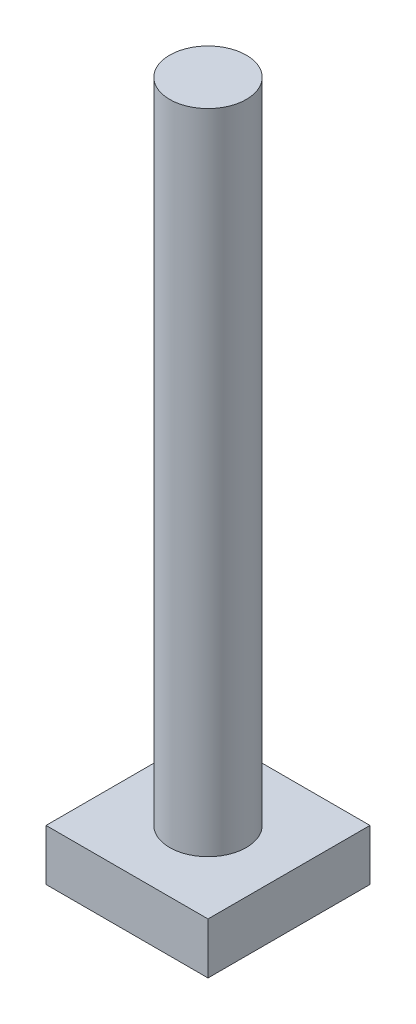
ISO-10303-21;
HEADER;
FILE_DESCRIPTION(('STEP AP214'),'2;1');
FILE_NAME('part.step','',(''),(''),'','','');
FILE_SCHEMA(('AUTOMOTIVE_DESIGN { 1 0 10303 214 1 1 1 1 }'));
ENDSEC;
DATA;
#1=APPLICATION_CONTEXT('core data for automotive mechanical design processes');
#2=APPLICATION_PROTOCOL_DEFINITION('international standard','automotive_design',2000,#1);
#3=PRODUCT_CONTEXT('',#1,'mechanical');
#4=PRODUCT('Part','Part','',(#3));
#5=PRODUCT_RELATED_PRODUCT_CATEGORY('part','',(#4));
#6=PRODUCT_DEFINITION_FORMATION('','',#4);
#7=PRODUCT_DEFINITION_CONTEXT('part definition',#1,'design');
#8=PRODUCT_DEFINITION('design','',#6,#7);
#9=PRODUCT_DEFINITION_SHAPE('','',#8);
#10=(LENGTH_UNIT() NAMED_UNIT(*) SI_UNIT(.MILLI.,.METRE.));
#11=(NAMED_UNIT(*) PLANE_ANGLE_UNIT() SI_UNIT($,.RADIAN.));
#12=(NAMED_UNIT(*) SI_UNIT($,.STERADIAN.) SOLID_ANGLE_UNIT());
#13=UNCERTAINTY_MEASURE_WITH_UNIT(LENGTH_MEASURE(1.E-05),#10,'distance_accuracy_value','');
#14=(GEOMETRIC_REPRESENTATION_CONTEXT(3) GLOBAL_UNCERTAINTY_ASSIGNED_CONTEXT((#13)) GLOBAL_UNIT_ASSIGNED_CONTEXT((#10,
#11,#12)) REPRESENTATION_CONTEXT('',''));
#15=CARTESIAN_POINT('',(0.,0.,0.));
#16=DIRECTION('',(0.,0.,1.));
#17=DIRECTION('',(1.,0.,0.));
#18=AXIS2_PLACEMENT_3D('',#15,#16,#17);
#19=CARTESIAN_POINT('',(9.5,6.,9.5));
#20=DIRECTION('',(-1.,0.,0.));
#21=DIRECTION('',(0.,0.,1.));
#22=AXIS2_PLACEMENT_3D('',#19,#20,#21);
#23=PLANE('',#22);
#24=DIRECTION('',(0.,0.,-1.));
#25=VECTOR('',#24,1.);
#26=CARTESIAN_POINT('',(9.5,0.,9.5));
#27=LINE('',#26,#25);
#28=CARTESIAN_POINT('',(9.5,0.,9.5));
#29=VERTEX_POINT('',#28);
#30=CARTESIAN_POINT('',(9.5,0.,-9.5));
#31=VERTEX_POINT('',#30);
#32=EDGE_CURVE('E99',#29,#31,#27,.T.);
#33=ORIENTED_EDGE('',*,*,#32,.T.);
#34=DIRECTION('',(0.,-1.,0.));
#35=VECTOR('',#34,1.);
#36=CARTESIAN_POINT('',(9.5,6.,-9.5));
#37=LINE('',#36,#35);
#38=CARTESIAN_POINT('',(9.5,6.,-9.5));
#39=VERTEX_POINT('',#38);
#40=EDGE_CURVE('E41',#39,#31,#37,.T.);
#41=ORIENTED_EDGE('',*,*,#40,.F.);
#42=DIRECTION('',(0.,0.,-1.));
#43=VECTOR('',#42,1.);
#44=CARTESIAN_POINT('',(9.5,6.,9.5));
#45=LINE('',#44,#43);
#46=CARTESIAN_POINT('',(9.5,6.,9.5));
#47=VERTEX_POINT('',#46);
#48=EDGE_CURVE('E85',#47,#39,#45,.T.);
#49=ORIENTED_EDGE('',*,*,#48,.F.);
#50=DIRECTION('',(0.,-1.,0.));
#51=VECTOR('',#50,1.);
#52=CARTESIAN_POINT('',(9.5,6.,9.5));
#53=LINE('',#52,#51);
#54=EDGE_CURVE('E95',#47,#29,#53,.T.);
#55=ORIENTED_EDGE('',*,*,#54,.T.);
#56=EDGE_LOOP('',(#33,#41,#49,#55));
#57=FACE_BOUND('',#56,.T.);
#58=ADVANCED_FACE('F33',(#57),#23,.F.);
#59=CARTESIAN_POINT('',(-9.5,6.,-9.5));
#60=DIRECTION('',(0.,0.,1.));
#61=DIRECTION('',(1.,0.,0.));
#62=AXIS2_PLACEMENT_3D('',#59,#60,#61);
#63=PLANE('',#62);
#64=DIRECTION('',(-1.,0.,0.));
#65=VECTOR('',#64,1.);
#66=CARTESIAN_POINT('',(-9.5,0.,-9.5));
#67=LINE('',#66,#65);
#68=CARTESIAN_POINT('',(-9.5,0.,-9.5));
#69=VERTEX_POINT('',#68);
#70=EDGE_CURVE('E90',#31,#69,#67,.T.);
#71=ORIENTED_EDGE('',*,*,#70,.T.);
#72=DIRECTION('',(0.,-1.,0.));
#73=VECTOR('',#72,1.);
#74=CARTESIAN_POINT('',(-9.5,6.,-9.5));
#75=LINE('',#74,#73);
#76=CARTESIAN_POINT('',(-9.5,6.,-9.5));
#77=VERTEX_POINT('',#76);
#78=EDGE_CURVE('E88',#77,#69,#75,.T.);
#79=ORIENTED_EDGE('',*,*,#78,.F.);
#80=DIRECTION('',(-1.,0.,0.));
#81=VECTOR('',#80,1.);
#82=CARTESIAN_POINT('',(-9.5,6.,-9.5));
#83=LINE('',#82,#81);
#84=EDGE_CURVE('E80',#39,#77,#83,.T.);
#85=ORIENTED_EDGE('',*,*,#84,.F.);
#86=ORIENTED_EDGE('',*,*,#40,.T.);
#87=EDGE_LOOP('',(#71,#79,#85,#86));
#88=FACE_BOUND('',#87,.T.);
#89=ADVANCED_FACE('F89',(#88),#63,.F.);
#90=CARTESIAN_POINT('',(-9.5,6.,9.5));
#91=DIRECTION('',(1.,0.,0.));
#92=DIRECTION('',(0.,0.,-1.));
#93=AXIS2_PLACEMENT_3D('',#90,#91,#92);
#94=PLANE('',#93);
#95=DIRECTION('',(0.,0.,1.));
#96=VECTOR('',#95,1.);
#97=CARTESIAN_POINT('',(-9.5,0.,9.5));
#98=LINE('',#97,#96);
#99=CARTESIAN_POINT('',(-9.5,0.,9.5));
#100=VERTEX_POINT('',#99);
#101=EDGE_CURVE('E66',#69,#100,#98,.T.);
#102=ORIENTED_EDGE('',*,*,#101,.T.);
#103=DIRECTION('',(0.,-1.,0.));
#104=VECTOR('',#103,1.);
#105=CARTESIAN_POINT('',(-9.5,6.,9.5));
#106=LINE('',#105,#104);
#107=CARTESIAN_POINT('',(-9.5,6.,9.5));
#108=VERTEX_POINT('',#107);
#109=EDGE_CURVE('E91',#108,#100,#106,.T.);
#110=ORIENTED_EDGE('',*,*,#109,.F.);
#111=DIRECTION('',(0.,0.,1.));
#112=VECTOR('',#111,1.);
#113=CARTESIAN_POINT('',(-9.5,6.,9.5));
#114=LINE('',#113,#112);
#115=EDGE_CURVE('E83',#77,#108,#114,.T.);
#116=ORIENTED_EDGE('',*,*,#115,.F.);
#117=ORIENTED_EDGE('',*,*,#78,.T.);
#118=EDGE_LOOP('',(#102,#110,#116,#117));
#119=FACE_BOUND('',#118,.T.);
#120=ADVANCED_FACE('F93',(#119),#94,.F.);
#121=CARTESIAN_POINT('',(-9.5,6.,9.5));
#122=DIRECTION('',(0.,0.,-1.));
#123=DIRECTION('',(-1.,0.,0.));
#124=AXIS2_PLACEMENT_3D('',#121,#122,#123);
#125=PLANE('',#124);
#126=DIRECTION('',(1.,0.,0.));
#127=VECTOR('',#126,1.);
#128=CARTESIAN_POINT('',(-9.5,0.,9.5));
#129=LINE('',#128,#127);
#130=EDGE_CURVE('E72',#100,#29,#129,.T.);
#131=ORIENTED_EDGE('',*,*,#130,.T.);
#132=ORIENTED_EDGE('',*,*,#54,.F.);
#133=DIRECTION('',(1.,0.,0.));
#134=VECTOR('',#133,1.);
#135=CARTESIAN_POINT('',(-9.5,6.,9.5));
#136=LINE('',#135,#134);
#137=EDGE_CURVE('E49',#108,#47,#136,.T.);
#138=ORIENTED_EDGE('',*,*,#137,.F.);
#139=ORIENTED_EDGE('',*,*,#109,.T.);
#140=EDGE_LOOP('',(#131,#132,#138,#139));
#141=FACE_BOUND('',#140,.T.);
#142=ADVANCED_FACE('F121',(#141),#125,.F.);
#143=CARTESIAN_POINT('',(0.,6.,0.));
#144=DIRECTION('',(0.,-1.,0.));
#145=DIRECTION('',(0.,0.,-1.));
#146=AXIS2_PLACEMENT_3D('',#143,#144,#145);
#147=PLANE('',#146);
#148=CARTESIAN_POINT('',(0.,6.00000000000001,0.));
#149=DIRECTION('',(0.,-1.,0.));
#150=DIRECTION('',(0.,0.,-1.));
#151=AXIS2_PLACEMENT_3D('',#148,#149,#150);
#152=CIRCLE('',#151,4.5);
#153=CARTESIAN_POINT('',(0.,6.00000000000001,-4.5));
#154=VERTEX_POINT('',#153);
#155=EDGE_CURVE('E11',#154,#154,#152,.F.);
#156=ORIENTED_EDGE('',*,*,#155,.F.);
#157=EDGE_LOOP('',(#156));
#158=FACE_BOUND('',#157,.T.);
#159=ORIENTED_EDGE('',*,*,#48,.T.);
#160=ORIENTED_EDGE('',*,*,#84,.T.);
#161=ORIENTED_EDGE('',*,*,#115,.T.);
#162=ORIENTED_EDGE('',*,*,#137,.T.);
#163=EDGE_LOOP('',(#159,#160,#161,#162));
#164=FACE_BOUND('',#163,.T.);
#165=ADVANCED_FACE('F81',(#158,#164),#147,.F.);
#166=CARTESIAN_POINT('',(0.,0.,0.));
#167=DIRECTION('',(0.,-1.,0.));
#168=DIRECTION('',(0.,0.,-1.));
#169=AXIS2_PLACEMENT_3D('',#166,#167,#168);
#170=PLANE('',#169);
#171=ORIENTED_EDGE('',*,*,#32,.F.);
#172=ORIENTED_EDGE('',*,*,#130,.F.);
#173=ORIENTED_EDGE('',*,*,#101,.F.);
#174=ORIENTED_EDGE('',*,*,#70,.F.);
#175=EDGE_LOOP('',(#171,#172,#173,#174));
#176=FACE_BOUND('',#175,.T.);
#177=ADVANCED_FACE('F110',(#176),#170,.T.);
#178=CARTESIAN_POINT('',(0.,82.,0.));
#179=DIRECTION('',(0.,-1.,0.));
#180=DIRECTION('',(0.,0.,-1.));
#181=AXIS2_PLACEMENT_3D('',#178,#179,#180);
#182=CYLINDRICAL_SURFACE('',#181,4.5);
#183=CARTESIAN_POINT('',(0.,82.,0.));
#184=DIRECTION('',(0.,1.,0.));
#185=DIRECTION('',(0.,0.,1.));
#186=AXIS2_PLACEMENT_3D('',#183,#184,#185);
#187=CIRCLE('',#186,4.5);
#188=CARTESIAN_POINT('',(0.,82.,4.5));
#189=VERTEX_POINT('',#188);
#190=EDGE_CURVE('E102',#189,#189,#187,.T.);
#191=ORIENTED_EDGE('',*,*,#190,.F.);
#192=EDGE_LOOP('',(#191));
#193=FACE_BOUND('',#192,.T.);
#194=ORIENTED_EDGE('',*,*,#155,.T.);
#195=EDGE_LOOP('',(#194));
#196=FACE_BOUND('',#195,.T.);
#197=ADVANCED_FACE('F112',(#193,#196),#182,.T.);
#198=CARTESIAN_POINT('',(0.,82.,0.));
#199=DIRECTION('',(0.,1.,0.));
#200=DIRECTION('',(0.,0.,1.));
#201=AXIS2_PLACEMENT_3D('',#198,#199,#200);
#202=PLANE('',#201);
#203=ORIENTED_EDGE('',*,*,#190,.T.);
#204=EDGE_LOOP('',(#203));
#205=FACE_BOUND('',#204,.T.);
#206=ADVANCED_FACE('F118',(#205),#202,.T.);
#207=CLOSED_SHELL('',(#58,#89,#120,#142,#165,#177,#197,#206));
#208=MANIFOLD_SOLID_BREP('B2',#207);
#209=ADVANCED_BREP_SHAPE_REPRESENTATION('',(#18,#208),#14);
#210=SHAPE_DEFINITION_REPRESENTATION(#9,#209);
ENDSEC;
END-ISO-10303-21;
